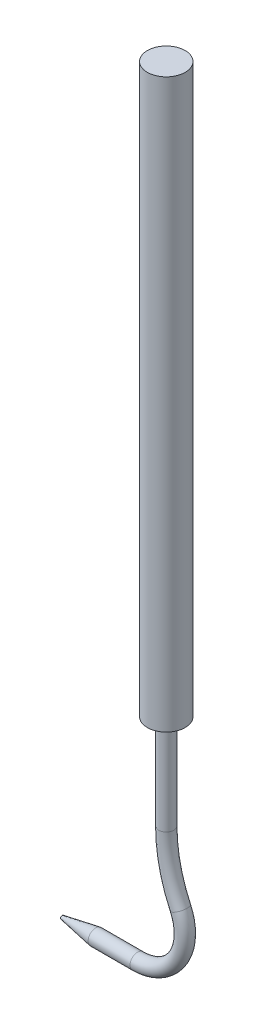
ISO-10303-21;
HEADER;
FILE_DESCRIPTION(('STEP AP214'),'2;1');
FILE_NAME('part.step','',(''),(''),'','','');
FILE_SCHEMA(('AUTOMOTIVE_DESIGN { 1 0 10303 214 1 1 1 1 }'));
ENDSEC;
DATA;
#1=APPLICATION_CONTEXT('core data for automotive mechanical design processes');
#2=APPLICATION_PROTOCOL_DEFINITION('international standard','automotive_design',2000,#1);
#3=PRODUCT_CONTEXT('',#1,'mechanical');
#4=PRODUCT('Part','Part','',(#3));
#5=PRODUCT_RELATED_PRODUCT_CATEGORY('part','',(#4));
#6=PRODUCT_DEFINITION_FORMATION('','',#4);
#7=PRODUCT_DEFINITION_CONTEXT('part definition',#1,'design');
#8=PRODUCT_DEFINITION('design','',#6,#7);
#9=PRODUCT_DEFINITION_SHAPE('','',#8);
#10=(LENGTH_UNIT() NAMED_UNIT(*) SI_UNIT(.MILLI.,.METRE.));
#11=(NAMED_UNIT(*) PLANE_ANGLE_UNIT() SI_UNIT($,.RADIAN.));
#12=(NAMED_UNIT(*) SI_UNIT($,.STERADIAN.) SOLID_ANGLE_UNIT());
#13=UNCERTAINTY_MEASURE_WITH_UNIT(LENGTH_MEASURE(1.E-05),#10,'distance_accuracy_value','');
#14=(GEOMETRIC_REPRESENTATION_CONTEXT(3) GLOBAL_UNCERTAINTY_ASSIGNED_CONTEXT((#13)) GLOBAL_UNIT_ASSIGNED_CONTEXT((#10,
#11,#12)) REPRESENTATION_CONTEXT('',''));
#15=CARTESIAN_POINT('',(0.,0.,0.));
#16=DIRECTION('',(0.,0.,1.));
#17=DIRECTION('',(1.,0.,0.));
#18=AXIS2_PLACEMENT_3D('',#15,#16,#17);
#19=CARTESIAN_POINT('',(0.,0.,0.));
#20=DIRECTION('',(1.,0.,0.));
#21=DIRECTION('',(0.,1.,0.));
#22=AXIS2_PLACEMENT_3D('',#19,#20,#21);
#23=CONICAL_SURFACE('',#22,0.,0.174532925199426);
#24=CARTESIAN_POINT('',(0.495927301772075,-0.0599193100097329,-0.0636893180981733));
#25=CARTESIAN_POINT('',(0.495498092603385,-0.0562557209886819,-0.0670318139788904));
#26=CARTESIAN_POINT('',(0.495073972885427,-0.052305547019576,-0.0700652222129503));
#27=CARTESIAN_POINT('',(0.494284979117062,-0.0439450352351168,-0.0754300153752601));
#28=CARTESIAN_POINT('',(0.493920165894695,-0.0395342324917922,-0.0777606815997576));
#29=CARTESIAN_POINT('',(0.493291540473905,-0.0303802518860058,-0.0816540190596));
#30=CARTESIAN_POINT('',(0.493027695923618,-0.025637181064418,-0.0832169363387219));
#31=CARTESIAN_POINT('',(0.492631424375256,-0.0159530744882479,-0.0855316890665569));
#32=CARTESIAN_POINT('',(0.492498962942421,-0.0110120909588479,-0.0862837370439537));
#33=CARTESIAN_POINT('',(0.492380832193578,-0.00108387941512584,-0.0869553726020689));
#34=CARTESIAN_POINT('',(0.492394815504679,0.00390321114208092,-0.0868769301350825));
#35=CARTESIAN_POINT('',(0.492567124906878,0.0137930150003003,-0.0858945258727991));
#36=CARTESIAN_POINT('',(0.492725456777071,0.0186957249150677,-0.0849905310259322));
#37=CARTESIAN_POINT('',(0.49316774661293,0.0282681467775837,-0.0823850692880316));
#38=CARTESIAN_POINT('',(0.493451461705294,0.0329382898528113,-0.0806851437760338));
#39=CARTESIAN_POINT('',(0.494112143618475,0.0419253353864989,-0.0765348468691002));
#40=CARTESIAN_POINT('',(0.494489115299009,0.04624221942058,-0.0740844363638639));
#41=CARTESIAN_POINT('',(0.495295562192607,0.0544203038340583,-0.0684858695571755));
#42=CARTESIAN_POINT('',(0.495725264373046,0.0582793829754353,-0.0653346459231207));
#43=CARTESIAN_POINT('',(0.49658703918543,0.0654085709239608,-0.0584243627126904));
#44=CARTESIAN_POINT('',(0.497019111803909,0.0686786830731408,-0.0546653065856262));
#45=CARTESIAN_POINT('',(0.497834349674168,0.0745184301072435,-0.046658879923551));
#46=CARTESIAN_POINT('',(0.498217728631143,0.0770911862785437,-0.0424138104544437));
#47=CARTESIAN_POINT('',(0.498893617751901,0.0814738703760172,-0.0335398789420335));
#48=CARTESIAN_POINT('',(0.499186141243955,0.0832839102046803,-0.0289110733182036));
#49=CARTESIAN_POINT('',(0.499640950277132,0.0860497006441211,-0.0195084722299787));
#50=CARTESIAN_POINT('',(0.499805932208183,0.0870231896190225,-0.0147400261893502));
#51=CARTESIAN_POINT('',(0.499997143101561,0.0881485817229523,-0.00510463573659315));
#52=CARTESIAN_POINT('',(0.500023391502389,0.0883005999515467,-0.000237705219443771));
#53=CARTESIAN_POINT('',(0.499935081431475,0.087783385482114,0.00935151046102272));
#54=CARTESIAN_POINT('',(0.499823366791571,0.0871307397707831,0.0140747277219239));
#55=CARTESIAN_POINT('',(0.499476330745252,0.0850539238169294,0.023343376254407));
#56=CARTESIAN_POINT('',(0.499241008405391,0.083629747748052,0.0278888061831169));
#57=CARTESIAN_POINT('',(0.498671504793856,0.080049568496475,0.0366915029850567));
#58=CARTESIAN_POINT('',(0.498337010090194,0.07789124181356,0.0409478028430291));
#59=CARTESIAN_POINT('',(0.49760540284098,0.0729089416756896,0.0490450309673239));
#60=CARTESIAN_POINT('',(0.497208282882114,0.0700848893953392,0.0528859099670182));
#61=CARTESIAN_POINT('',(0.496384033529785,0.0637797084141506,0.0601376121097124));
#62=CARTESIAN_POINT('',(0.495956426255864,0.0602850617999713,0.0635366280363944));
#63=CARTESIAN_POINT('',(0.495126168121516,0.0527807580010499,0.0697123537193614));
#64=CARTESIAN_POINT('',(0.494723519917792,0.0487710461306268,0.0724889973108724));
#65=CARTESIAN_POINT('',(0.493980034877239,0.0402652158883791,0.0773952375450685));
#66=CARTESIAN_POINT('',(0.493640518259935,0.0357613013604775,0.0795115335596274));
#67=CARTESIAN_POINT('',(0.493071607807295,0.0264580004549997,0.082966712075869));
#68=CARTESIAN_POINT('',(0.492842213787125,0.0216586145733666,0.0843055958823842));
#69=CARTESIAN_POINT('',(0.492519618590317,0.0118909075535921,0.0861703828993113));
#70=CARTESIAN_POINT('',(0.49242666130622,0.00692230009433093,0.0866948303306983));
#71=CARTESIAN_POINT('',(0.492388538254316,-0.0030334895544606,0.086911110728339));
#72=CARTESIAN_POINT('',(0.492443369492367,-0.00802067136563708,0.0866029605627186));
#73=CARTESIAN_POINT('',(0.492693915008209,-0.0178509799743018,0.0851658689216751));
#74=CARTESIAN_POINT('',(0.492889060522849,-0.0226946064009422,0.0840402409039133));
#75=CARTESIAN_POINT('',(0.493397214915414,-0.0321225077010559,0.0810033379293474));
#76=CARTESIAN_POINT('',(0.493710228739296,-0.0367067716819458,0.0790920300037462));
#77=CARTESIAN_POINT('',(0.494419700345064,-0.0455016970768526,0.0745284216065298));
#78=CARTESIAN_POINT('',(0.494816417398188,-0.0497111384837601,0.0718738101906165));
#79=CARTESIAN_POINT('',(0.495647761940338,-0.0576218087160437,0.0658966854148219));
#80=CARTESIAN_POINT('',(0.496082390792807,-0.0613230192513134,0.0625741480283571));
#81=CARTESIAN_POINT('',(0.496940677068854,-0.0681130208893578,0.0553461074684011));
#82=CARTESIAN_POINT('',(0.497364324961166,-0.0712012944940374,0.051440116524125));
#83=CARTESIAN_POINT('',(0.498151657827852,-0.0766671410945954,0.0431533717683494));
#84=CARTESIAN_POINT('',(0.498515348762316,-0.0790447847505619,0.0387726652183209));
#85=CARTESIAN_POINT('',(0.499135217412169,-0.0829797037553431,0.0297353927189801));
#86=CARTESIAN_POINT('',(0.499393056892294,-0.0845497654314958,0.0250845131577302));
#87=CARTESIAN_POINT('',(0.499779865038668,-0.0868746307218086,0.015578394942539));
#88=CARTESIAN_POINT('',(0.499908859076222,-0.0876295948414078,0.0107231967178457));
#89=CARTESIAN_POINT('',(0.500021584958753,-0.0882901942938002,0.00107174118819914));
#90=CARTESIAN_POINT('',(0.500008744685992,-0.0882158715619263,-0.00372311414547858));
#91=CARTESIAN_POINT('',(0.499847513059144,-0.0872686083193954,-0.0132316447312602));
#92=CARTESIAN_POINT('',(0.499699103583723,-0.0863955610443963,-0.0179453090448596));
#93=CARTESIAN_POINT('',(0.499284582049715,-0.0838878607668001,-0.0271279239322582));
#94=CARTESIAN_POINT('',(0.499019198341459,-0.0822579173342437,-0.0315981994412782));
#95=CARTESIAN_POINT('',(0.498399808526633,-0.0782898766549833,-0.040202390776509));
#96=CARTESIAN_POINT('',(0.498045872488027,-0.0759523389941526,-0.0443365691325341));
#97=CARTESIAN_POINT('',(0.497392638914337,-0.0713791562351252,-0.0510748864110642));
#98=CARTESIAN_POINT('',(0.497105485801475,-0.0692956735387318,-0.0537849767451628));
#99=CARTESIAN_POINT('',(0.496520519045436,-0.064826488753682,-0.0589419610562808));
#100=CARTESIAN_POINT('',(0.496222705002563,-0.0624407753253542,-0.0613888451514514));
#101=CARTESIAN_POINT('',(0.495927301772075,-0.0599193100097329,-0.0636893180981733));
#102=B_SPLINE_CURVE_WITH_KNOTS('',3,(#24,#25,#26,#27,#28,#29,#30,#31,#32,#33,#34,#35,#36,#37,
#38,#39,#40,#41,#42,#43,#44,#45,#46,#47,#48,#49,#50,#51,#52,#53,#54,#55,#56,#57,#58,#59,#60,#61,
#62,#63,#64,#65,#66,#67,#68,#69,#70,#71,#72,#73,#74,#75,#76,#77,#78,#79,#80,#81,#82,#83,#84,#85,
#86,#87,#88,#89,#90,#91,#92,#93,#94,#95,#96,#97,#98,#99,#100,#101),.UNSPECIFIED.,.T.,.F.,(4,2,2,
2,2,2,2,2,2,2,2,2,2,2,2,2,2,2,2,2,2,2,2,2,2,2,2,2,2,2,2,2,2,2,2,2,2,2,4),(0.,0.014920901007013,
0.0298570104621866,0.0447883301508386,0.059715735391517,0.0746077402547995,0.0895003413561037,
0.104364220362973,0.119228874108478,0.134159915018473,0.149090871201171,0.163953851143882,
0.178814649693657,0.19335196075218,0.20788723487683,0.22212783101439,0.236368534693953,
0.250654734478208,0.264942626673683,0.279556407935376,0.29417174206078,0.309064852358346,
0.323957937658788,0.33887761335731,0.353796986790868,0.368656223115649,0.383516083029196,
0.398422665532662,0.41332978435059,0.428249436092938,0.443167603835209,0.45784168067615,
0.472512867434863,0.486830269202587,0.501149585036137,0.515380972903594,0.52960113545308,
0.53987006086781,0.550139371685924),.UNSPECIFIED.);
#103=CARTESIAN_POINT('',(0.495927301772075,-0.0599193100097329,-0.0636893180981733));
#104=VERTEX_POINT('',#103);
#105=EDGE_CURVE('E33',#104,#104,#102,.T.);
#106=ORIENTED_EDGE('',*,*,#105,.T.);
#107=EDGE_LOOP('',(#106));
#108=FACE_BOUND('',#107,.T.);
#109=CARTESIAN_POINT('',(2.26851272784718,0.,0.));
#110=DIRECTION('',(1.,0.,0.));
#111=DIRECTION('',(0.,1.,0.));
#112=AXIS2_PLACEMENT_3D('',#109,#110,#111);
#113=CIRCLE('',#112,0.4);
#114=CARTESIAN_POINT('',(2.26851272784718,0.4,0.));
#115=VERTEX_POINT('',#114);
#116=EDGE_CURVE('E10',#115,#115,#113,.T.);
#117=ORIENTED_EDGE('',*,*,#116,.F.);
#118=EDGE_LOOP('',(#117));
#119=FACE_BOUND('',#118,.T.);
#120=ADVANCED_FACE('F29',(#108,#119),#23,.T.);
#121=CARTESIAN_POINT('',(0.,0.,0.));
#122=DIRECTION('',(1.,0.,0.));
#123=DIRECTION('',(0.,1.,0.));
#124=AXIS2_PLACEMENT_3D('',#121,#122,#123);
#125=CYLINDRICAL_SURFACE('',#124,0.4);
#126=ORIENTED_EDGE('',*,*,#116,.T.);
#127=EDGE_LOOP('',(#126));
#128=FACE_BOUND('',#127,.T.);
#129=CARTESIAN_POINT('',(4.48376823611517,0.,0.));
#130=DIRECTION('',(1.,0.,0.));
#131=DIRECTION('',(0.,1.,0.));
#132=AXIS2_PLACEMENT_3D('',#129,#130,#131);
#133=CIRCLE('',#132,0.400000000000006);
#134=CARTESIAN_POINT('',(4.48376823611517,0.400000000000006,0.));
#135=VERTEX_POINT('',#134);
#136=EDGE_CURVE('E53',#135,#135,#133,.T.);
#137=ORIENTED_EDGE('',*,*,#136,.F.);
#138=EDGE_LOOP('',(#137));
#139=FACE_BOUND('',#138,.T.);
#140=ADVANCED_FACE('F81',(#128,#139),#125,.T.);
#141=CARTESIAN_POINT('',(0.,-0.4,0.));
#142=DIRECTION('',(0.,1.,0.));
#143=DIRECTION('',(0.,0.,1.));
#144=AXIS2_PLACEMENT_3D('',#141,#142,#143);
#145=CYLINDRICAL_SURFACE('',#144,0.5);
#146=ORIENTED_EDGE('',*,*,#105,.F.);
#147=EDGE_LOOP('',(#146));
#148=FACE_BOUND('',#147,.T.);
#149=ADVANCED_FACE('F86',(#148),#145,.F.);
#150=CARTESIAN_POINT('',(6.,6.93749174827732,0.));
#151=DIRECTION('',(0.,1.,0.));
#152=DIRECTION('',(0.,0.,1.));
#153=AXIS2_PLACEMENT_3D('',#150,#151,#152);
#154=CYLINDRICAL_SURFACE('',#153,0.400000000000006);
#155=CARTESIAN_POINT('',(6.,6.93749174827732,0.));
#156=DIRECTION('',(0.,1.,0.));
#157=DIRECTION('',(-1.,0.,0.));
#158=AXIS2_PLACEMENT_3D('',#155,#156,#157);
#159=CIRCLE('',#158,0.400000000000006);
#160=CARTESIAN_POINT('',(5.6,6.93749174827732,0.));
#161=VERTEX_POINT('',#160);
#162=EDGE_CURVE('E47',#161,#161,#159,.T.);
#163=ORIENTED_EDGE('',*,*,#162,.T.);
#164=EDGE_LOOP('',(#163));
#165=FACE_BOUND('',#164,.T.);
#166=CARTESIAN_POINT('',(6.,11.9374917482773,0.));
#167=DIRECTION('',(0.,1.,0.));
#168=DIRECTION('',(-1.,0.,0.));
#169=AXIS2_PLACEMENT_3D('',#166,#167,#168);
#170=CIRCLE('',#169,0.400000000000006);
#171=CARTESIAN_POINT('',(5.6,11.9374917482773,0.));
#172=VERTEX_POINT('',#171);
#173=EDGE_CURVE('E43',#172,#172,#170,.T.);
#174=ORIENTED_EDGE('',*,*,#173,.F.);
#175=EDGE_LOOP('',(#174));
#176=FACE_BOUND('',#175,.T.);
#177=ADVANCED_FACE('F91',(#165,#176),#154,.T.);
#178=CARTESIAN_POINT('',(14.,6.93749174827732,0.));
#179=DIRECTION('',(0.,0.,-1.));
#180=DIRECTION('',(-1.,0.,0.));
#181=AXIS2_PLACEMENT_3D('',#178,#179,#180);
#182=TOROIDAL_SURFACE('',#181,8.,0.400000000000006);
#183=CARTESIAN_POINT('',(6.7495377037068,3.55654565435174,0.));
#184=DIRECTION('',(-0.422618261740697,0.906307787036651,0.));
#185=DIRECTION('',(-0.906307787036651,-0.422618261740697,0.));
#186=AXIS2_PLACEMENT_3D('',#183,#184,#185);
#187=CIRCLE('',#186,0.400000000000006);
#188=CARTESIAN_POINT('',(6.38701458889213,3.38749834965546,0.));
#189=VERTEX_POINT('',#188);
#190=EDGE_CURVE('E50',#189,#189,#187,.T.);
#191=CARTESIAN_POINT('',(14.,6.93749174827732,0.));
#192=DIRECTION('',(0.,0.,-1.));
#193=DIRECTION('',(-1.,0.,0.));
#194=AXIS2_PLACEMENT_3D('',#191,#192,#193);
#195=CIRCLE('',#194,8.40000000000001);
#196=EDGE_CURVE('',#189,#161,#195,.T.);
#197=ORIENTED_EDGE('',*,*,#190,.T.);
#198=ORIENTED_EDGE('',*,*,#162,.F.);
#199=ORIENTED_EDGE('',*,*,#196,.T.);
#200=ORIENTED_EDGE('',*,*,#196,.F.);
#201=EDGE_LOOP('',(#197,#199,#198,#200));
#202=FACE_BOUND('',#201,.T.);
#203=ADVANCED_FACE('F95',(#202),#182,.T.);
#204=CARTESIAN_POINT('',(4.48376823611517,2.5,0.));
#205=DIRECTION('',(0.,0.,1.));
#206=DIRECTION('',(1.,0.,0.));
#207=AXIS2_PLACEMENT_3D('',#204,#205,#206);
#208=TOROIDAL_SURFACE('',#207,2.5,0.400000000000006);
#209=ORIENTED_EDGE('',*,*,#136,.T.);
#210=EDGE_LOOP('',(#209));
#211=FACE_BOUND('',#210,.T.);
#212=ORIENTED_EDGE('',*,*,#190,.F.);
#213=EDGE_LOOP('',(#212));
#214=FACE_BOUND('',#213,.T.);
#215=ADVANCED_FACE('F68',(#211,#214),#208,.T.);
#216=CARTESIAN_POINT('',(6.00000000000001,41.9374917482773,0.));
#217=DIRECTION('',(0.,-1.,0.));
#218=DIRECTION('',(1.,0.,0.));
#219=AXIS2_PLACEMENT_3D('',#216,#217,#218);
#220=CYLINDRICAL_SURFACE('',#219,1.00000000000001);
#221=CARTESIAN_POINT('',(6.00000000000001,41.9374917482773,0.));
#222=DIRECTION('',(0.,1.,0.));
#223=DIRECTION('',(-1.,0.,0.));
#224=AXIS2_PLACEMENT_3D('',#221,#222,#223);
#225=CIRCLE('',#224,1.00000000000001);
#226=CARTESIAN_POINT('',(5.,41.9374917482773,0.));
#227=VERTEX_POINT('',#226);
#228=EDGE_CURVE('E56',#227,#227,#225,.T.);
#229=ORIENTED_EDGE('',*,*,#228,.F.);
#230=EDGE_LOOP('',(#229));
#231=FACE_BOUND('',#230,.T.);
#232=CARTESIAN_POINT('',(6.,11.9374917482773,0.));
#233=DIRECTION('',(0.,1.,0.));
#234=DIRECTION('',(-1.,0.,0.));
#235=AXIS2_PLACEMENT_3D('',#232,#233,#234);
#236=CIRCLE('',#235,1.00000000000001);
#237=CARTESIAN_POINT('',(4.99999999999999,11.9374917482773,0.));
#238=VERTEX_POINT('',#237);
#239=EDGE_CURVE('E57',#238,#238,#236,.T.);
#240=ORIENTED_EDGE('',*,*,#239,.T.);
#241=EDGE_LOOP('',(#240));
#242=FACE_BOUND('',#241,.T.);
#243=ADVANCED_FACE('F65',(#231,#242),#220,.T.);
#244=CARTESIAN_POINT('',(6.00000000000001,41.9374917482773,0.));
#245=DIRECTION('',(0.,1.,0.));
#246=DIRECTION('',(-1.,0.,0.));
#247=AXIS2_PLACEMENT_3D('',#244,#245,#246);
#248=PLANE('',#247);
#249=ORIENTED_EDGE('',*,*,#228,.T.);
#250=EDGE_LOOP('',(#249));
#251=FACE_BOUND('',#250,.T.);
#252=ADVANCED_FACE('F63',(#251),#248,.T.);
#253=CARTESIAN_POINT('',(6.,11.9374917482773,0.));
#254=DIRECTION('',(0.,1.,0.));
#255=DIRECTION('',(-1.,0.,0.));
#256=AXIS2_PLACEMENT_3D('',#253,#254,#255);
#257=PLANE('',#256);
#258=ORIENTED_EDGE('',*,*,#173,.T.);
#259=EDGE_LOOP('',(#258));
#260=FACE_BOUND('',#259,.T.);
#261=ORIENTED_EDGE('',*,*,#239,.F.);
#262=EDGE_LOOP('',(#261));
#263=FACE_BOUND('',#262,.T.);
#264=ADVANCED_FACE('F72',(#260,#263),#257,.F.);
#265=CLOSED_SHELL('',(#120,#140,#149,#177,#203,#215,#243,#252,#264));
#266=MANIFOLD_SOLID_BREP('B2',#265);
#267=ADVANCED_BREP_SHAPE_REPRESENTATION('',(#18,#266),#14);
#268=SHAPE_DEFINITION_REPRESENTATION(#9,#267);
ENDSEC;
END-ISO-10303-21;
